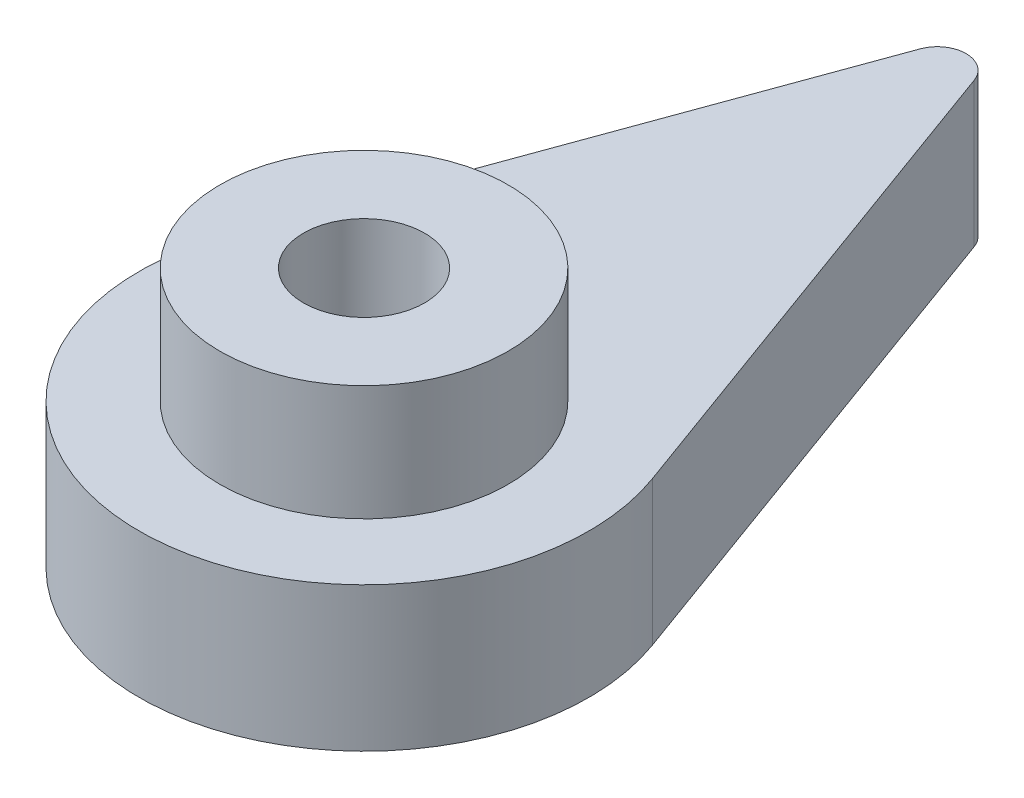
ISO-10303-21;
HEADER;
FILE_DESCRIPTION(('STEP AP214'),'2;1');
FILE_NAME('part.step','',(''),(''),'','','');
FILE_SCHEMA(('AUTOMOTIVE_DESIGN { 1 0 10303 214 1 1 1 1 }'));
ENDSEC;
DATA;
#1=APPLICATION_CONTEXT('core data for automotive mechanical design processes');
#2=APPLICATION_PROTOCOL_DEFINITION('international standard','automotive_design',2000,#1);
#3=PRODUCT_CONTEXT('',#1,'mechanical');
#4=PRODUCT('Part','Part','',(#3));
#5=PRODUCT_RELATED_PRODUCT_CATEGORY('part','',(#4));
#6=PRODUCT_DEFINITION_FORMATION('','',#4);
#7=PRODUCT_DEFINITION_CONTEXT('part definition',#1,'design');
#8=PRODUCT_DEFINITION('design','',#6,#7);
#9=PRODUCT_DEFINITION_SHAPE('','',#8);
#10=(LENGTH_UNIT() NAMED_UNIT(*) SI_UNIT(.MILLI.,.METRE.));
#11=(NAMED_UNIT(*) PLANE_ANGLE_UNIT() SI_UNIT($,.RADIAN.));
#12=(NAMED_UNIT(*) SI_UNIT($,.STERADIAN.) SOLID_ANGLE_UNIT());
#13=UNCERTAINTY_MEASURE_WITH_UNIT(LENGTH_MEASURE(1.E-05),#10,'distance_accuracy_value','');
#14=(GEOMETRIC_REPRESENTATION_CONTEXT(3) GLOBAL_UNCERTAINTY_ASSIGNED_CONTEXT((#13)) GLOBAL_UNIT_ASSIGNED_CONTEXT((#10,
#11,#12)) REPRESENTATION_CONTEXT('',''));
#15=CARTESIAN_POINT('',(0.,0.,0.));
#16=DIRECTION('',(0.,0.,1.));
#17=DIRECTION('',(1.,0.,0.));
#18=AXIS2_PLACEMENT_3D('',#15,#16,#17);
#19=CARTESIAN_POINT('',(0.,5.,0.));
#20=DIRECTION('',(0.,1.,0.));
#21=DIRECTION('',(0.,0.,1.));
#22=AXIS2_PLACEMENT_3D('',#19,#20,#21);
#23=PLANE('',#22);
#24=CARTESIAN_POINT('',(0.,5.,0.));
#25=DIRECTION('',(0.,1.,0.));
#26=DIRECTION('',(0.,0.,1.));
#27=AXIS2_PLACEMENT_3D('',#24,#25,#26);
#28=CIRCLE('',#27,7.8);
#29=CARTESIAN_POINT('',(-7.32960244213009,5.,-2.6677571179402));
#30=VERTEX_POINT('',#29);
#31=CARTESIAN_POINT('',(7.32960244213009,5.,-2.6677571179402));
#32=VERTEX_POINT('',#31);
#33=EDGE_CURVE('E182',#30,#32,#28,.T.);
#34=ORIENTED_EDGE('',*,*,#33,.T.);
#35=DIRECTION('',(-0.342020143325666,0.,-0.939692620785909));
#36=VECTOR('',#35,1.);
#37=CARTESIAN_POINT('',(7.32960244213009,5.,-2.6677571179402));
#38=LINE('',#37,#36);
#39=CARTESIAN_POINT('',(0.939692556233227,5.,-20.2238902417919));
#40=VERTEX_POINT('',#39);
#41=EDGE_CURVE('E89',#32,#40,#38,.T.);
#42=ORIENTED_EDGE('',*,*,#41,.T.);
#43=CARTESIAN_POINT('',(0.,5.,-19.8818701219615));
#44=DIRECTION('',(0.,1.,0.));
#45=DIRECTION('',(0.,0.,1.));
#46=AXIS2_PLACEMENT_3D('',#43,#44,#45);
#47=CIRCLE('',#46,0.999999931304467);
#48=CARTESIAN_POINT('',(-0.939692556233225,5.,-20.2238902417919));
#49=VERTEX_POINT('',#48);
#50=EDGE_CURVE('E185',#40,#49,#47,.T.);
#51=ORIENTED_EDGE('',*,*,#50,.T.);
#52=DIRECTION('',(-0.342020143325666,0.,0.939692620785909));
#53=VECTOR('',#52,1.);
#54=CARTESIAN_POINT('',(-0.939692556233223,5.,-20.2238902417919));
#55=LINE('',#54,#53);
#56=EDGE_CURVE('E61',#49,#30,#55,.T.);
#57=ORIENTED_EDGE('',*,*,#56,.T.);
#58=EDGE_LOOP('',(#34,#42,#51,#57));
#59=FACE_BOUND('',#58,.T.);
#60=CARTESIAN_POINT('',(0.,5.,0.));
#61=DIRECTION('',(0.,1.,0.));
#62=DIRECTION('',(0.,0.,1.));
#63=AXIS2_PLACEMENT_3D('',#60,#61,#62);
#64=CIRCLE('',#63,5.);
#65=CARTESIAN_POINT('',(0.,5.,5.));
#66=VERTEX_POINT('',#65);
#67=EDGE_CURVE('E151',#66,#66,#64,.T.);
#68=ORIENTED_EDGE('',*,*,#67,.F.);
#69=EDGE_LOOP('',(#68));
#70=FACE_BOUND('',#69,.T.);
#71=ADVANCED_FACE('F36',(#59,#70),#23,.T.);
#72=CARTESIAN_POINT('',(0.,-0.00100000000000013,0.));
#73=DIRECTION('',(0.,1.,0.));
#74=DIRECTION('',(0.,0.,1.));
#75=AXIS2_PLACEMENT_3D('',#72,#73,#74);
#76=CYLINDRICAL_SURFACE('',#75,2.1);
#77=CARTESIAN_POINT('',(0.,1.8,0.));
#78=DIRECTION('',(0.,-1.,0.));
#79=DIRECTION('',(0.,0.,-1.));
#80=AXIS2_PLACEMENT_3D('',#77,#78,#79);
#81=CIRCLE('',#80,2.1);
#82=CARTESIAN_POINT('',(0.,1.8,-2.1));
#83=VERTEX_POINT('',#82);
#84=EDGE_CURVE('E40',#83,#83,#81,.F.);
#85=ORIENTED_EDGE('',*,*,#84,.F.);
#86=EDGE_LOOP('',(#85));
#87=FACE_BOUND('',#86,.T.);
#88=CARTESIAN_POINT('',(0.,9.,0.));
#89=DIRECTION('',(0.,1.,0.));
#90=DIRECTION('',(0.,0.,1.));
#91=AXIS2_PLACEMENT_3D('',#88,#89,#90);
#92=CIRCLE('',#91,2.1);
#93=CARTESIAN_POINT('',(0.,9.,2.1));
#94=VERTEX_POINT('',#93);
#95=EDGE_CURVE('E269',#94,#94,#92,.T.);
#96=ORIENTED_EDGE('',*,*,#95,.T.);
#97=EDGE_LOOP('',(#96));
#98=FACE_BOUND('',#97,.T.);
#99=ADVANCED_FACE('F224',(#87,#98),#76,.F.);
#100=CARTESIAN_POINT('',(0.,5.,0.));
#101=DIRECTION('',(0.,-1.,0.));
#102=DIRECTION('',(0.,0.,-1.));
#103=AXIS2_PLACEMENT_3D('',#100,#101,#102);
#104=CYLINDRICAL_SURFACE('',#103,7.8);
#105=CARTESIAN_POINT('',(0.,0.,0.));
#106=DIRECTION('',(0.,1.,0.));
#107=DIRECTION('',(0.,0.,1.));
#108=AXIS2_PLACEMENT_3D('',#105,#106,#107);
#109=CIRCLE('',#108,7.8);
#110=CARTESIAN_POINT('',(-7.32960244213009,0.,-2.6677571179402));
#111=VERTEX_POINT('',#110);
#112=CARTESIAN_POINT('',(7.32960244213009,0.,-2.6677571179402));
#113=VERTEX_POINT('',#112);
#114=EDGE_CURVE('E189',#111,#113,#109,.T.);
#115=ORIENTED_EDGE('',*,*,#114,.T.);
#116=DIRECTION('',(0.,-1.,0.));
#117=VECTOR('',#116,1.);
#118=CARTESIAN_POINT('',(7.32960244213009,5.,-2.6677571179402));
#119=LINE('',#118,#117);
#120=EDGE_CURVE('E11',#32,#113,#119,.T.);
#121=ORIENTED_EDGE('',*,*,#120,.F.);
#122=ORIENTED_EDGE('',*,*,#33,.F.);
#123=DIRECTION('',(0.,-1.,0.));
#124=VECTOR('',#123,1.);
#125=CARTESIAN_POINT('',(-7.32960244213009,5.,-2.6677571179402));
#126=LINE('',#125,#124);
#127=EDGE_CURVE('E188',#30,#111,#126,.T.);
#128=ORIENTED_EDGE('',*,*,#127,.T.);
#129=EDGE_LOOP('',(#115,#121,#122,#128));
#130=FACE_BOUND('',#129,.T.);
#131=ADVANCED_FACE('F38',(#130),#104,.T.);
#132=CARTESIAN_POINT('',(7.32960244213009,5.,-2.6677571179402));
#133=DIRECTION('',(-0.939692620785909,0.,0.342020143325666));
#134=DIRECTION('',(0.342020143325666,0.,0.939692620785909));
#135=AXIS2_PLACEMENT_3D('',#132,#133,#134);
#136=PLANE('',#135);
#137=DIRECTION('',(-0.342020143325666,0.,-0.939692620785909));
#138=VECTOR('',#137,1.);
#139=CARTESIAN_POINT('',(7.32960244213009,0.,-2.6677571179402));
#140=LINE('',#139,#138);
#141=CARTESIAN_POINT('',(0.939692556233227,0.,-20.2238902417919));
#142=VERTEX_POINT('',#141);
#143=EDGE_CURVE('E192',#113,#142,#140,.T.);
#144=ORIENTED_EDGE('',*,*,#143,.T.);
#145=DIRECTION('',(0.,-1.,0.));
#146=VECTOR('',#145,1.);
#147=CARTESIAN_POINT('',(0.939692556233227,5.,-20.2238902417919));
#148=LINE('',#147,#146);
#149=EDGE_CURVE('E45',#40,#142,#148,.T.);
#150=ORIENTED_EDGE('',*,*,#149,.F.);
#151=ORIENTED_EDGE('',*,*,#41,.F.);
#152=ORIENTED_EDGE('',*,*,#120,.T.);
#153=EDGE_LOOP('',(#144,#150,#151,#152));
#154=FACE_BOUND('',#153,.T.);
#155=ADVANCED_FACE('F221',(#154),#136,.F.);
#156=CARTESIAN_POINT('',(0.,5.,-19.8818701219615));
#157=DIRECTION('',(0.,-1.,0.));
#158=DIRECTION('',(0.,0.,-1.));
#159=AXIS2_PLACEMENT_3D('',#156,#157,#158);
#160=CYLINDRICAL_SURFACE('',#159,0.999999931304467);
#161=CARTESIAN_POINT('',(0.,0.,-19.8818701219615));
#162=DIRECTION('',(0.,1.,0.));
#163=DIRECTION('',(0.,0.,1.));
#164=AXIS2_PLACEMENT_3D('',#161,#162,#163);
#165=CIRCLE('',#164,0.999999931304467);
#166=CARTESIAN_POINT('',(-0.939692556233225,0.,-20.2238902417919));
#167=VERTEX_POINT('',#166);
#168=EDGE_CURVE('E194',#142,#167,#165,.T.);
#169=ORIENTED_EDGE('',*,*,#168,.T.);
#170=DIRECTION('',(0.,-1.,0.));
#171=VECTOR('',#170,1.);
#172=CARTESIAN_POINT('',(-0.939692556233225,5.,-20.2238902417919));
#173=LINE('',#172,#171);
#174=EDGE_CURVE('E198',#49,#167,#173,.T.);
#175=ORIENTED_EDGE('',*,*,#174,.F.);
#176=ORIENTED_EDGE('',*,*,#50,.F.);
#177=ORIENTED_EDGE('',*,*,#149,.T.);
#178=EDGE_LOOP('',(#169,#175,#176,#177));
#179=FACE_BOUND('',#178,.T.);
#180=ADVANCED_FACE('F204',(#179),#160,.T.);
#181=CARTESIAN_POINT('',(-0.939692556233223,5.,-20.2238902417919));
#182=DIRECTION('',(0.939692620785909,0.,0.342020143325666));
#183=DIRECTION('',(0.342020143325666,0.,-0.93969262078591));
#184=AXIS2_PLACEMENT_3D('',#181,#182,#183);
#185=PLANE('',#184);
#186=DIRECTION('',(-0.342020143325666,0.,0.939692620785909));
#187=VECTOR('',#186,1.);
#188=CARTESIAN_POINT('',(-0.939692556233223,0.,-20.2238902417919));
#189=LINE('',#188,#187);
#190=EDGE_CURVE('E82',#167,#111,#189,.T.);
#191=ORIENTED_EDGE('',*,*,#190,.T.);
#192=ORIENTED_EDGE('',*,*,#127,.F.);
#193=ORIENTED_EDGE('',*,*,#56,.F.);
#194=ORIENTED_EDGE('',*,*,#174,.T.);
#195=EDGE_LOOP('',(#191,#192,#193,#194));
#196=FACE_BOUND('',#195,.T.);
#197=ADVANCED_FACE('F212',(#196),#185,.F.);
#198=CARTESIAN_POINT('',(0.,0.,0.));
#199=DIRECTION('',(0.,1.,0.));
#200=DIRECTION('',(0.,0.,1.));
#201=AXIS2_PLACEMENT_3D('',#198,#199,#200);
#202=PLANE('',#201);
#203=DIRECTION('',(-0.866025403784439,0.,-0.5));
#204=VECTOR('',#203,1.);
#205=CARTESIAN_POINT('',(0.,0.,4.27239199200323));
#206=LINE('',#205,#204);
#207=CARTESIAN_POINT('',(0.,0.,4.27239199200323));
#208=VERTEX_POINT('',#207);
#209=CARTESIAN_POINT('',(-3.7,0.,2.13619599600162));
#210=VERTEX_POINT('',#209);
#211=EDGE_CURVE('E162',#208,#210,#206,.T.);
#212=ORIENTED_EDGE('',*,*,#211,.F.);
#213=DIRECTION('',(-0.866025403784439,0.,0.5));
#214=VECTOR('',#213,1.);
#215=CARTESIAN_POINT('',(3.7,0.,2.13619599600162));
#216=LINE('',#215,#214);
#217=CARTESIAN_POINT('',(3.7,0.,2.13619599600162));
#218=VERTEX_POINT('',#217);
#219=EDGE_CURVE('E52',#218,#208,#216,.T.);
#220=ORIENTED_EDGE('',*,*,#219,.F.);
#221=DIRECTION('',(0.,0.,1.));
#222=VECTOR('',#221,1.);
#223=CARTESIAN_POINT('',(3.7,0.,-2.13619599600162));
#224=LINE('',#223,#222);
#225=CARTESIAN_POINT('',(3.7,0.,-2.13619599600162));
#226=VERTEX_POINT('',#225);
#227=EDGE_CURVE('E145',#226,#218,#224,.T.);
#228=ORIENTED_EDGE('',*,*,#227,.F.);
#229=DIRECTION('',(0.866025403784439,0.,0.5));
#230=VECTOR('',#229,1.);
#231=CARTESIAN_POINT('',(0.,0.,-4.27239199200323));
#232=LINE('',#231,#230);
#233=CARTESIAN_POINT('',(0.,0.,-4.27239199200323));
#234=VERTEX_POINT('',#233);
#235=EDGE_CURVE('E148',#234,#226,#232,.T.);
#236=ORIENTED_EDGE('',*,*,#235,.F.);
#237=DIRECTION('',(0.866025403784439,0.,-0.5));
#238=VECTOR('',#237,1.);
#239=CARTESIAN_POINT('',(-3.7,0.,-2.13619599600162));
#240=LINE('',#239,#238);
#241=CARTESIAN_POINT('',(-3.7,0.,-2.13619599600162));
#242=VERTEX_POINT('',#241);
#243=EDGE_CURVE('E168',#242,#234,#240,.T.);
#244=ORIENTED_EDGE('',*,*,#243,.F.);
#245=DIRECTION('',(0.,0.,-1.));
#246=VECTOR('',#245,1.);
#247=CARTESIAN_POINT('',(-3.7,0.,2.13619599600162));
#248=LINE('',#247,#246);
#249=EDGE_CURVE('E165',#210,#242,#248,.T.);
#250=ORIENTED_EDGE('',*,*,#249,.F.);
#251=EDGE_LOOP('',(#212,#220,#228,#236,#244,#250));
#252=FACE_BOUND('',#251,.T.);
#253=ORIENTED_EDGE('',*,*,#114,.F.);
#254=ORIENTED_EDGE('',*,*,#190,.F.);
#255=ORIENTED_EDGE('',*,*,#168,.F.);
#256=ORIENTED_EDGE('',*,*,#143,.F.);
#257=EDGE_LOOP('',(#253,#254,#255,#256));
#258=FACE_BOUND('',#257,.T.);
#259=ADVANCED_FACE('F208',(#252,#258),#202,.F.);
#260=CARTESIAN_POINT('',(0.,1.8,0.));
#261=DIRECTION('',(0.,-1.,0.));
#262=DIRECTION('',(0.,0.,-1.));
#263=AXIS2_PLACEMENT_3D('',#260,#261,#262);
#264=PLANE('',#263);
#265=DIRECTION('',(-0.866025403784439,0.,0.5));
#266=VECTOR('',#265,1.);
#267=CARTESIAN_POINT('',(3.7,1.8,2.13619599600162));
#268=LINE('',#267,#266);
#269=CARTESIAN_POINT('',(3.7,1.8,2.13619599600162));
#270=VERTEX_POINT('',#269);
#271=CARTESIAN_POINT('',(0.,1.8,4.27239199200323));
#272=VERTEX_POINT('',#271);
#273=EDGE_CURVE('E125',#270,#272,#268,.T.);
#274=ORIENTED_EDGE('',*,*,#273,.T.);
#275=DIRECTION('',(-0.866025403784439,0.,-0.5));
#276=VECTOR('',#275,1.);
#277=CARTESIAN_POINT('',(0.,1.8,4.27239199200323));
#278=LINE('',#277,#276);
#279=CARTESIAN_POINT('',(-3.7,1.8,2.13619599600162));
#280=VERTEX_POINT('',#279);
#281=EDGE_CURVE('E134',#272,#280,#278,.T.);
#282=ORIENTED_EDGE('',*,*,#281,.T.);
#283=DIRECTION('',(0.,0.,-1.));
#284=VECTOR('',#283,1.);
#285=CARTESIAN_POINT('',(-3.7,1.8,2.13619599600162));
#286=LINE('',#285,#284);
#287=CARTESIAN_POINT('',(-3.7,1.8,-2.13619599600162));
#288=VERTEX_POINT('',#287);
#289=EDGE_CURVE('E139',#280,#288,#286,.T.);
#290=ORIENTED_EDGE('',*,*,#289,.T.);
#291=DIRECTION('',(0.866025403784439,0.,-0.5));
#292=VECTOR('',#291,1.);
#293=CARTESIAN_POINT('',(-3.7,1.8,-2.13619599600162));
#294=LINE('',#293,#292);
#295=CARTESIAN_POINT('',(0.,1.8,-4.27239199200323));
#296=VERTEX_POINT('',#295);
#297=EDGE_CURVE('E155',#288,#296,#294,.T.);
#298=ORIENTED_EDGE('',*,*,#297,.T.);
#299=DIRECTION('',(0.866025403784439,0.,0.5));
#300=VECTOR('',#299,1.);
#301=CARTESIAN_POINT('',(0.,1.8,-4.27239199200323));
#302=LINE('',#301,#300);
#303=CARTESIAN_POINT('',(3.7,1.8,-2.13619599600162));
#304=VERTEX_POINT('',#303);
#305=EDGE_CURVE('E158',#296,#304,#302,.T.);
#306=ORIENTED_EDGE('',*,*,#305,.T.);
#307=DIRECTION('',(0.,0.,1.));
#308=VECTOR('',#307,1.);
#309=CARTESIAN_POINT('',(3.7,1.8,-2.13619599600162));
#310=LINE('',#309,#308);
#311=EDGE_CURVE('E131',#304,#270,#310,.T.);
#312=ORIENTED_EDGE('',*,*,#311,.T.);
#313=EDGE_LOOP('',(#274,#282,#290,#298,#306,#312));
#314=FACE_BOUND('',#313,.T.);
#315=ORIENTED_EDGE('',*,*,#84,.T.);
#316=EDGE_LOOP('',(#315));
#317=FACE_BOUND('',#316,.T.);
#318=ADVANCED_FACE('F141',(#314,#317),#264,.T.);
#319=CARTESIAN_POINT('',(3.7,1.8,2.13619599600162));
#320=DIRECTION('',(0.5,0.,0.866025403784439));
#321=DIRECTION('',(0.866025403784439,0.,-0.5));
#322=AXIS2_PLACEMENT_3D('',#319,#320,#321);
#323=PLANE('',#322);
#324=ORIENTED_EDGE('',*,*,#219,.T.);
#325=DIRECTION('',(0.,-1.,0.));
#326=VECTOR('',#325,1.);
#327=CARTESIAN_POINT('',(0.,1.8,4.27239199200323));
#328=LINE('',#327,#326);
#329=EDGE_CURVE('E121',#272,#208,#328,.T.);
#330=ORIENTED_EDGE('',*,*,#329,.F.);
#331=ORIENTED_EDGE('',*,*,#273,.F.);
#332=DIRECTION('',(0.,-1.,0.));
#333=VECTOR('',#332,1.);
#334=CARTESIAN_POINT('',(3.7,1.8,2.13619599600162));
#335=LINE('',#334,#333);
#336=EDGE_CURVE('E173',#270,#218,#335,.T.);
#337=ORIENTED_EDGE('',*,*,#336,.T.);
#338=EDGE_LOOP('',(#324,#330,#331,#337));
#339=FACE_BOUND('',#338,.T.);
#340=ADVANCED_FACE('F123',(#339),#323,.F.);
#341=CARTESIAN_POINT('',(3.7,1.8,-2.13619599600162));
#342=DIRECTION('',(1.,0.,0.));
#343=DIRECTION('',(0.,0.,-1.));
#344=AXIS2_PLACEMENT_3D('',#341,#342,#343);
#345=PLANE('',#344);
#346=ORIENTED_EDGE('',*,*,#227,.T.);
#347=ORIENTED_EDGE('',*,*,#336,.F.);
#348=ORIENTED_EDGE('',*,*,#311,.F.);
#349=DIRECTION('',(0.,-1.,0.));
#350=VECTOR('',#349,1.);
#351=CARTESIAN_POINT('',(3.7,1.8,-2.13619599600162));
#352=LINE('',#351,#350);
#353=EDGE_CURVE('E175',#304,#226,#352,.T.);
#354=ORIENTED_EDGE('',*,*,#353,.T.);
#355=EDGE_LOOP('',(#346,#347,#348,#354));
#356=FACE_BOUND('',#355,.T.);
#357=ADVANCED_FACE('F235',(#356),#345,.F.);
#358=CARTESIAN_POINT('',(0.,1.8,-4.27239199200323));
#359=DIRECTION('',(0.5,0.,-0.866025403784439));
#360=DIRECTION('',(-0.866025403784439,0.,-0.5));
#361=AXIS2_PLACEMENT_3D('',#358,#359,#360);
#362=PLANE('',#361);
#363=ORIENTED_EDGE('',*,*,#235,.T.);
#364=ORIENTED_EDGE('',*,*,#353,.F.);
#365=ORIENTED_EDGE('',*,*,#305,.F.);
#366=DIRECTION('',(0.,-1.,0.));
#367=VECTOR('',#366,1.);
#368=CARTESIAN_POINT('',(0.,1.8,-4.27239199200323));
#369=LINE('',#368,#367);
#370=EDGE_CURVE('E177',#296,#234,#369,.T.);
#371=ORIENTED_EDGE('',*,*,#370,.T.);
#372=EDGE_LOOP('',(#363,#364,#365,#371));
#373=FACE_BOUND('',#372,.T.);
#374=ADVANCED_FACE('F246',(#373),#362,.F.);
#375=CARTESIAN_POINT('',(-3.7,1.8,-2.13619599600162));
#376=DIRECTION('',(-0.5,0.,-0.866025403784438));
#377=DIRECTION('',(-0.866025403784439,0.,0.5));
#378=AXIS2_PLACEMENT_3D('',#375,#376,#377);
#379=PLANE('',#378);
#380=ORIENTED_EDGE('',*,*,#243,.T.);
#381=ORIENTED_EDGE('',*,*,#370,.F.);
#382=ORIENTED_EDGE('',*,*,#297,.F.);
#383=DIRECTION('',(0.,-1.,0.));
#384=VECTOR('',#383,1.);
#385=CARTESIAN_POINT('',(-3.7,1.8,-2.13619599600162));
#386=LINE('',#385,#384);
#387=EDGE_CURVE('E179',#288,#242,#386,.T.);
#388=ORIENTED_EDGE('',*,*,#387,.T.);
#389=EDGE_LOOP('',(#380,#381,#382,#388));
#390=FACE_BOUND('',#389,.T.);
#391=ADVANCED_FACE('F242',(#390),#379,.F.);
#392=CARTESIAN_POINT('',(-3.7,1.8,2.13619599600162));
#393=DIRECTION('',(-1.,0.,0.));
#394=DIRECTION('',(0.,0.,1.));
#395=AXIS2_PLACEMENT_3D('',#392,#393,#394);
#396=PLANE('',#395);
#397=ORIENTED_EDGE('',*,*,#249,.T.);
#398=ORIENTED_EDGE('',*,*,#387,.F.);
#399=ORIENTED_EDGE('',*,*,#289,.F.);
#400=DIRECTION('',(0.,-1.,0.));
#401=VECTOR('',#400,1.);
#402=CARTESIAN_POINT('',(-3.7,1.8,2.13619599600162));
#403=LINE('',#402,#401);
#404=EDGE_CURVE('E130',#280,#210,#403,.T.);
#405=ORIENTED_EDGE('',*,*,#404,.T.);
#406=EDGE_LOOP('',(#397,#398,#399,#405));
#407=FACE_BOUND('',#406,.T.);
#408=ADVANCED_FACE('F239',(#407),#396,.F.);
#409=CARTESIAN_POINT('',(0.,1.8,4.27239199200323));
#410=DIRECTION('',(-0.5,0.,0.866025403784439));
#411=DIRECTION('',(0.866025403784439,0.,0.5));
#412=AXIS2_PLACEMENT_3D('',#409,#410,#411);
#413=PLANE('',#412);
#414=ORIENTED_EDGE('',*,*,#211,.T.);
#415=ORIENTED_EDGE('',*,*,#404,.F.);
#416=ORIENTED_EDGE('',*,*,#281,.F.);
#417=ORIENTED_EDGE('',*,*,#329,.T.);
#418=EDGE_LOOP('',(#414,#415,#416,#417));
#419=FACE_BOUND('',#418,.T.);
#420=ADVANCED_FACE('F135',(#419),#413,.F.);
#421=CARTESIAN_POINT('',(0.,9.,0.));
#422=DIRECTION('',(0.,1.,0.));
#423=DIRECTION('',(0.,0.,1.));
#424=AXIS2_PLACEMENT_3D('',#421,#422,#423);
#425=PLANE('',#424);
#426=CARTESIAN_POINT('',(0.,9.,0.));
#427=DIRECTION('',(0.,1.,0.));
#428=DIRECTION('',(0.,0.,1.));
#429=AXIS2_PLACEMENT_3D('',#426,#427,#428);
#430=CIRCLE('',#429,5.);
#431=CARTESIAN_POINT('',(0.,9.,5.));
#432=VERTEX_POINT('',#431);
#433=EDGE_CURVE('E163',#432,#432,#430,.T.);
#434=ORIENTED_EDGE('',*,*,#433,.T.);
#435=EDGE_LOOP('',(#434));
#436=FACE_BOUND('',#435,.T.);
#437=ORIENTED_EDGE('',*,*,#95,.F.);
#438=EDGE_LOOP('',(#437));
#439=FACE_BOUND('',#438,.T.);
#440=ADVANCED_FACE('F238',(#436,#439),#425,.T.);
#441=CARTESIAN_POINT('',(0.,9.,0.));
#442=DIRECTION('',(0.,-1.,0.));
#443=DIRECTION('',(0.,0.,-1.));
#444=AXIS2_PLACEMENT_3D('',#441,#442,#443);
#445=CYLINDRICAL_SURFACE('',#444,5.);
#446=ORIENTED_EDGE('',*,*,#433,.F.);
#447=EDGE_LOOP('',(#446));
#448=FACE_BOUND('',#447,.T.);
#449=ORIENTED_EDGE('',*,*,#67,.T.);
#450=EDGE_LOOP('',(#449));
#451=FACE_BOUND('',#450,.T.);
#452=ADVANCED_FACE('F256',(#448,#451),#445,.T.);
#453=CLOSED_SHELL('',(#71,#99,#131,#155,#180,#197,#259,#318,#340,#357,#374,#391,#408,#420,#440,#452));
#454=MANIFOLD_SOLID_BREP('B2',#453);
#455=ADVANCED_BREP_SHAPE_REPRESENTATION('',(#18,#454),#14);
#456=SHAPE_DEFINITION_REPRESENTATION(#9,#455);
ENDSEC;
END-ISO-10303-21;
